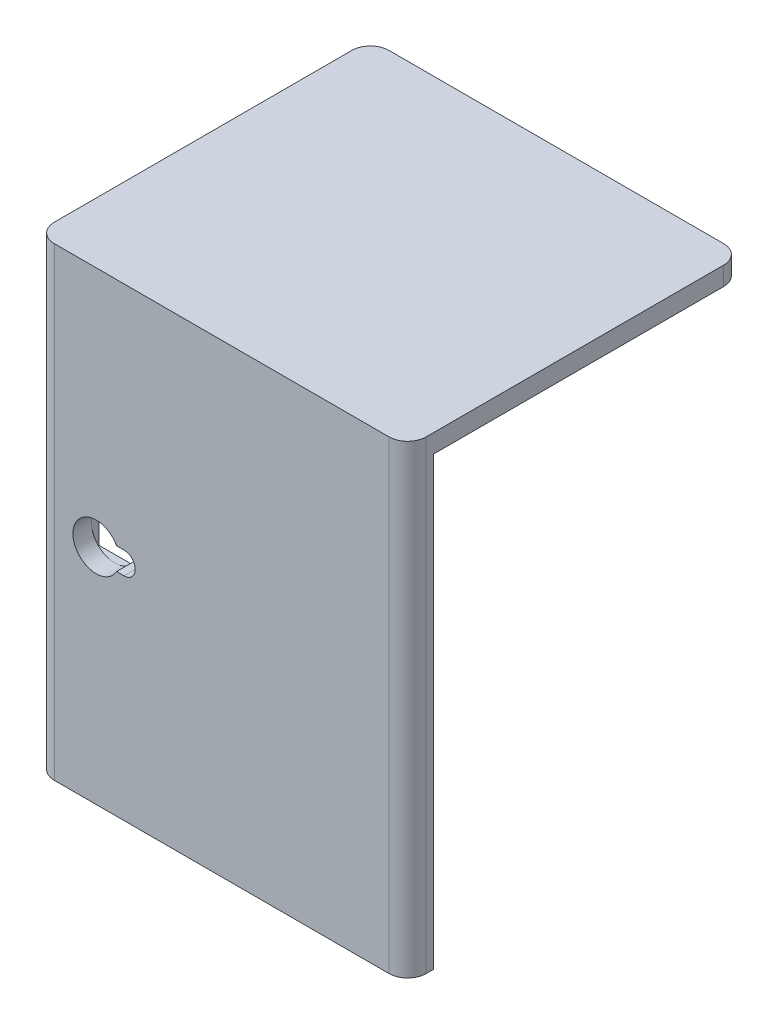
ISO-10303-21;
HEADER;
FILE_DESCRIPTION(('STEP AP214'),'2;1');
FILE_NAME('part.step','',(''),(''),'','','');
FILE_SCHEMA(('AUTOMOTIVE_DESIGN { 1 0 10303 214 1 1 1 1 }'));
ENDSEC;
DATA;
#1=APPLICATION_CONTEXT('core data for automotive mechanical design processes');
#2=APPLICATION_PROTOCOL_DEFINITION('international standard','automotive_design',2000,#1);
#3=PRODUCT_CONTEXT('',#1,'mechanical');
#4=PRODUCT('Part','Part','',(#3));
#5=PRODUCT_RELATED_PRODUCT_CATEGORY('part','',(#4));
#6=PRODUCT_DEFINITION_FORMATION('','',#4);
#7=PRODUCT_DEFINITION_CONTEXT('part definition',#1,'design');
#8=PRODUCT_DEFINITION('design','',#6,#7);
#9=PRODUCT_DEFINITION_SHAPE('','',#8);
#10=(LENGTH_UNIT() NAMED_UNIT(*) SI_UNIT(.MILLI.,.METRE.));
#11=(NAMED_UNIT(*) PLANE_ANGLE_UNIT() SI_UNIT($,.RADIAN.));
#12=(NAMED_UNIT(*) SI_UNIT($,.STERADIAN.) SOLID_ANGLE_UNIT());
#13=UNCERTAINTY_MEASURE_WITH_UNIT(LENGTH_MEASURE(1.E-05),#10,'distance_accuracy_value','');
#14=(GEOMETRIC_REPRESENTATION_CONTEXT(3) GLOBAL_UNCERTAINTY_ASSIGNED_CONTEXT((#13)) GLOBAL_UNIT_ASSIGNED_CONTEXT((#10,
#11,#12)) REPRESENTATION_CONTEXT('',''));
#15=CARTESIAN_POINT('',(0.,0.,0.));
#16=DIRECTION('',(0.,0.,1.));
#17=DIRECTION('',(1.,0.,0.));
#18=AXIS2_PLACEMENT_3D('',#15,#16,#17);
#19=CARTESIAN_POINT('',(-33.75,60.,158.));
#20=DIRECTION('',(0.,0.,-1.));
#21=DIRECTION('',(-1.,0.,0.));
#22=AXIS2_PLACEMENT_3D('',#19,#20,#21);
#23=CYLINDRICAL_SURFACE('',#22,6.25);
#24=CARTESIAN_POINT('',(-33.75,60.,40.));
#25=DIRECTION('',(0.,0.,1.));
#26=DIRECTION('',(1.,0.,0.));
#27=AXIS2_PLACEMENT_3D('',#24,#25,#26);
#28=CIRCLE('',#27,6.25);
#29=CARTESIAN_POINT('',(-33.75,53.75,40.));
#30=VERTEX_POINT('',#29);
#31=CARTESIAN_POINT('',(-40.,60.,40.));
#32=VERTEX_POINT('',#31);
#33=EDGE_CURVE('E224',#30,#32,#28,.F.);
#34=ORIENTED_EDGE('',*,*,#33,.T.);
#35=CARTESIAN_POINT('',(-33.75,66.25,40.));
#36=VERTEX_POINT('',#35);
#37=EDGE_CURVE('E183',#32,#36,#28,.F.);
#38=ORIENTED_EDGE('',*,*,#37,.T.);
#39=CARTESIAN_POINT('',(-28.2670719501347,63.,40.));
#40=VERTEX_POINT('',#39);
#41=EDGE_CURVE('E225',#36,#40,#28,.F.);
#42=ORIENTED_EDGE('',*,*,#41,.T.);
#43=DIRECTION('',(0.,0.,-1.));
#44=VECTOR('',#43,1.);
#45=CARTESIAN_POINT('',(-28.2670719501347,63.,158.));
#46=LINE('',#45,#44);
#47=CARTESIAN_POINT('',(-28.2670719501347,63.,45.));
#48=VERTEX_POINT('',#47);
#49=EDGE_CURVE('E236',#48,#40,#46,.T.);
#50=ORIENTED_EDGE('',*,*,#49,.F.);
#51=CARTESIAN_POINT('',(-33.75,60.,45.));
#52=DIRECTION('',(0.,0.,-1.));
#53=DIRECTION('',(-1.,0.,0.));
#54=AXIS2_PLACEMENT_3D('',#51,#52,#53);
#55=CIRCLE('',#54,6.25);
#56=CARTESIAN_POINT('',(-28.2670719501347,57.,45.));
#57=VERTEX_POINT('',#56);
#58=EDGE_CURVE('E247',#57,#48,#55,.T.);
#59=ORIENTED_EDGE('',*,*,#58,.F.);
#60=DIRECTION('',(0.,0.,-1.));
#61=VECTOR('',#60,1.);
#62=CARTESIAN_POINT('',(-28.2670719501347,57.,158.));
#63=LINE('',#62,#61);
#64=CARTESIAN_POINT('',(-28.2670719501347,57.,40.));
#65=VERTEX_POINT('',#64);
#66=EDGE_CURVE('E239',#57,#65,#63,.T.);
#67=ORIENTED_EDGE('',*,*,#66,.T.);
#68=EDGE_CURVE('E66',#65,#30,#28,.F.);
#69=ORIENTED_EDGE('',*,*,#68,.T.);
#70=EDGE_LOOP('',(#34,#38,#42,#50,#59,#67,#69));
#71=FACE_BOUND('',#70,.T.);
#72=ADVANCED_FACE('F43',(#71),#23,.F.);
#73=CARTESIAN_POINT('',(50.,125.,45.));
#74=DIRECTION('',(-1.,0.,0.));
#75=DIRECTION('',(0.,0.,1.));
#76=AXIS2_PLACEMENT_3D('',#73,#74,#75);
#77=PLANE('',#76);
#78=DIRECTION('',(0.,0.,-1.));
#79=VECTOR('',#78,1.);
#80=CARTESIAN_POINT('',(50.,125.,45.));
#81=LINE('',#80,#79);
#82=CARTESIAN_POINT('',(50.,125.,40.));
#83=VERTEX_POINT('',#82);
#84=CARTESIAN_POINT('',(50.,125.,-40.));
#85=VERTEX_POINT('',#84);
#86=EDGE_CURVE('E276',#83,#85,#81,.T.);
#87=ORIENTED_EDGE('',*,*,#86,.F.);
#88=DIRECTION('',(0.,-1.,0.));
#89=VECTOR('',#88,1.);
#90=CARTESIAN_POINT('',(50.,125.,40.));
#91=LINE('',#90,#89);
#92=CARTESIAN_POINT('',(50.,0.,40.));
#93=VERTEX_POINT('',#92);
#94=EDGE_CURVE('E319',#83,#93,#91,.T.);
#95=ORIENTED_EDGE('',*,*,#94,.T.);
#96=DIRECTION('',(0.,0.,-1.));
#97=VECTOR('',#96,1.);
#98=CARTESIAN_POINT('',(50.,0.,45.));
#99=LINE('',#98,#97);
#100=CARTESIAN_POINT('',(50.,0.,38.));
#101=VERTEX_POINT('',#100);
#102=EDGE_CURVE('E273',#93,#101,#99,.T.);
#103=ORIENTED_EDGE('',*,*,#102,.T.);
#104=DIRECTION('',(0.,-1.,0.));
#105=VECTOR('',#104,1.);
#106=CARTESIAN_POINT('',(50.,120.,38.));
#107=LINE('',#106,#105);
#108=CARTESIAN_POINT('',(50.,120.,38.));
#109=VERTEX_POINT('',#108);
#110=EDGE_CURVE('E268',#109,#101,#107,.T.);
#111=ORIENTED_EDGE('',*,*,#110,.F.);
#112=DIRECTION('',(0.,0.,1.));
#113=VECTOR('',#112,1.);
#114=CARTESIAN_POINT('',(50.,120.,-45.));
#115=LINE('',#114,#113);
#116=CARTESIAN_POINT('',(50.,120.,-40.));
#117=VERTEX_POINT('',#116);
#118=EDGE_CURVE('E257',#117,#109,#115,.T.);
#119=ORIENTED_EDGE('',*,*,#118,.F.);
#120=DIRECTION('',(0.,-1.,0.));
#121=VECTOR('',#120,1.);
#122=CARTESIAN_POINT('',(50.,125.,-40.));
#123=LINE('',#122,#121);
#124=EDGE_CURVE('E317',#117,#85,#123,.F.);
#125=ORIENTED_EDGE('',*,*,#124,.T.);
#126=EDGE_LOOP('',(#87,#95,#103,#111,#119,#125));
#127=FACE_BOUND('',#126,.T.);
#128=ADVANCED_FACE('F339',(#127),#77,.F.);
#129=CARTESIAN_POINT('',(-50.,125.,-45.));
#130=DIRECTION('',(0.,0.,1.));
#131=DIRECTION('',(1.,0.,0.));
#132=AXIS2_PLACEMENT_3D('',#129,#130,#131);
#133=PLANE('',#132);
#134=DIRECTION('',(-1.,0.,0.));
#135=VECTOR('',#134,1.);
#136=CARTESIAN_POINT('',(-50.,125.,-45.));
#137=LINE('',#136,#135);
#138=CARTESIAN_POINT('',(45.,125.,-45.));
#139=VERTEX_POINT('',#138);
#140=CARTESIAN_POINT('',(-45.,125.,-45.));
#141=VERTEX_POINT('',#140);
#142=EDGE_CURVE('E279',#139,#141,#137,.T.);
#143=ORIENTED_EDGE('',*,*,#142,.F.);
#144=DIRECTION('',(0.,-1.,0.));
#145=VECTOR('',#144,1.);
#146=CARTESIAN_POINT('',(45.,125.,-45.));
#147=LINE('',#146,#145);
#148=CARTESIAN_POINT('',(45.,120.,-45.));
#149=VERTEX_POINT('',#148);
#150=EDGE_CURVE('E324',#139,#149,#147,.T.);
#151=ORIENTED_EDGE('',*,*,#150,.T.);
#152=DIRECTION('',(1.,0.,0.));
#153=VECTOR('',#152,1.);
#154=CARTESIAN_POINT('',(-50.,120.,-45.));
#155=LINE('',#154,#153);
#156=CARTESIAN_POINT('',(-45.,120.,-45.));
#157=VERTEX_POINT('',#156);
#158=EDGE_CURVE('E265',#157,#149,#155,.T.);
#159=ORIENTED_EDGE('',*,*,#158,.F.);
#160=DIRECTION('',(0.,-1.,0.));
#161=VECTOR('',#160,1.);
#162=CARTESIAN_POINT('',(-45.,125.,-45.));
#163=LINE('',#162,#161);
#164=EDGE_CURVE('E322',#157,#141,#163,.F.);
#165=ORIENTED_EDGE('',*,*,#164,.T.);
#166=EDGE_LOOP('',(#143,#151,#159,#165));
#167=FACE_BOUND('',#166,.T.);
#168=ADVANCED_FACE('F347',(#167),#133,.F.);
#169=CARTESIAN_POINT('',(-50.,125.,45.));
#170=DIRECTION('',(1.,0.,0.));
#171=DIRECTION('',(0.,0.,-1.));
#172=AXIS2_PLACEMENT_3D('',#169,#170,#171);
#173=PLANE('',#172);
#174=DIRECTION('',(0.,0.,1.));
#175=VECTOR('',#174,1.);
#176=CARTESIAN_POINT('',(-50.,0.,45.));
#177=LINE('',#176,#175);
#178=CARTESIAN_POINT('',(-50.,0.,38.));
#179=VERTEX_POINT('',#178);
#180=CARTESIAN_POINT('',(-50.,0.,40.));
#181=VERTEX_POINT('',#180);
#182=EDGE_CURVE('E291',#179,#181,#177,.T.);
#183=ORIENTED_EDGE('',*,*,#182,.T.);
#184=DIRECTION('',(0.,-1.,0.));
#185=VECTOR('',#184,1.);
#186=CARTESIAN_POINT('',(-50.,125.,40.));
#187=LINE('',#186,#185);
#188=CARTESIAN_POINT('',(-50.,125.,40.));
#189=VERTEX_POINT('',#188);
#190=EDGE_CURVE('E307',#181,#189,#187,.F.);
#191=ORIENTED_EDGE('',*,*,#190,.T.);
#192=DIRECTION('',(0.,0.,1.));
#193=VECTOR('',#192,1.);
#194=CARTESIAN_POINT('',(-50.,125.,45.));
#195=LINE('',#194,#193);
#196=CARTESIAN_POINT('',(-50.,125.,-40.));
#197=VERTEX_POINT('',#196);
#198=EDGE_CURVE('E283',#197,#189,#195,.T.);
#199=ORIENTED_EDGE('',*,*,#198,.F.);
#200=DIRECTION('',(0.,-1.,0.));
#201=VECTOR('',#200,1.);
#202=CARTESIAN_POINT('',(-50.,125.,-40.));
#203=LINE('',#202,#201);
#204=CARTESIAN_POINT('',(-50.,120.,-40.));
#205=VERTEX_POINT('',#204);
#206=EDGE_CURVE('E304',#197,#205,#203,.T.);
#207=ORIENTED_EDGE('',*,*,#206,.T.);
#208=DIRECTION('',(0.,0.,-1.));
#209=VECTOR('',#208,1.);
#210=CARTESIAN_POINT('',(-50.,120.,-45.));
#211=LINE('',#210,#209);
#212=CARTESIAN_POINT('',(-50.,120.,38.));
#213=VERTEX_POINT('',#212);
#214=EDGE_CURVE('E262',#213,#205,#211,.T.);
#215=ORIENTED_EDGE('',*,*,#214,.F.);
#216=DIRECTION('',(0.,-1.,0.));
#217=VECTOR('',#216,1.);
#218=CARTESIAN_POINT('',(-50.,120.,38.));
#219=LINE('',#218,#217);
#220=EDGE_CURVE('E270',#213,#179,#219,.T.);
#221=ORIENTED_EDGE('',*,*,#220,.T.);
#222=EDGE_LOOP('',(#183,#191,#199,#207,#215,#221));
#223=FACE_BOUND('',#222,.T.);
#224=ADVANCED_FACE('F354',(#223),#173,.F.);
#225=CARTESIAN_POINT('',(-50.,125.,45.));
#226=DIRECTION('',(0.,0.,-1.));
#227=DIRECTION('',(-1.,0.,0.));
#228=AXIS2_PLACEMENT_3D('',#225,#226,#227);
#229=PLANE('',#228);
#230=DIRECTION('',(1.,0.,0.));
#231=VECTOR('',#230,1.);
#232=CARTESIAN_POINT('',(-50.,63.,45.));
#233=LINE('',#232,#231);
#234=CARTESIAN_POINT('',(-26.25,63.,45.));
#235=VERTEX_POINT('',#234);
#236=EDGE_CURVE('E250',#48,#235,#233,.T.);
#237=ORIENTED_EDGE('',*,*,#236,.T.);
#238=CARTESIAN_POINT('',(-26.25,60.,45.));
#239=DIRECTION('',(0.,0.,-1.));
#240=DIRECTION('',(-1.,0.,0.));
#241=AXIS2_PLACEMENT_3D('',#238,#239,#240);
#242=CIRCLE('',#241,3.);
#243=CARTESIAN_POINT('',(-26.25,57.,45.));
#244=VERTEX_POINT('',#243);
#245=EDGE_CURVE('E253',#235,#244,#242,.T.);
#246=ORIENTED_EDGE('',*,*,#245,.T.);
#247=DIRECTION('',(-1.,0.,0.));
#248=VECTOR('',#247,1.);
#249=CARTESIAN_POINT('',(-50.,57.,45.));
#250=LINE('',#249,#248);
#251=EDGE_CURVE('E235',#244,#57,#250,.T.);
#252=ORIENTED_EDGE('',*,*,#251,.T.);
#253=ORIENTED_EDGE('',*,*,#58,.T.);
#254=EDGE_LOOP('',(#237,#246,#252,#253));
#255=FACE_BOUND('',#254,.T.);
#256=DIRECTION('',(1.,0.,0.));
#257=VECTOR('',#256,1.);
#258=CARTESIAN_POINT('',(-50.,125.,45.));
#259=LINE('',#258,#257);
#260=CARTESIAN_POINT('',(-45.,125.,45.));
#261=VERTEX_POINT('',#260);
#262=CARTESIAN_POINT('',(45.,125.,45.));
#263=VERTEX_POINT('',#262);
#264=EDGE_CURVE('E286',#261,#263,#259,.T.);
#265=ORIENTED_EDGE('',*,*,#264,.F.);
#266=DIRECTION('',(0.,-1.,0.));
#267=VECTOR('',#266,1.);
#268=CARTESIAN_POINT('',(-45.,125.,45.));
#269=LINE('',#268,#267);
#270=CARTESIAN_POINT('',(-45.,0.,45.));
#271=VERTEX_POINT('',#270);
#272=EDGE_CURVE('E297',#261,#271,#269,.T.);
#273=ORIENTED_EDGE('',*,*,#272,.T.);
#274=DIRECTION('',(1.,0.,0.));
#275=VECTOR('',#274,1.);
#276=CARTESIAN_POINT('',(-50.,0.,45.));
#277=LINE('',#276,#275);
#278=CARTESIAN_POINT('',(45.,0.,45.));
#279=VERTEX_POINT('',#278);
#280=EDGE_CURVE('E280',#271,#279,#277,.T.);
#281=ORIENTED_EDGE('',*,*,#280,.T.);
#282=DIRECTION('',(0.,-1.,0.));
#283=VECTOR('',#282,1.);
#284=CARTESIAN_POINT('',(45.,125.,45.));
#285=LINE('',#284,#283);
#286=EDGE_CURVE('E289',#279,#263,#285,.F.);
#287=ORIENTED_EDGE('',*,*,#286,.T.);
#288=EDGE_LOOP('',(#265,#273,#281,#287));
#289=FACE_BOUND('',#288,.T.);
#290=ADVANCED_FACE('F364',(#255,#289),#229,.F.);
#291=CARTESIAN_POINT('',(0.,125.,0.));
#292=DIRECTION('',(0.,-1.,0.));
#293=DIRECTION('',(0.,0.,-1.));
#294=AXIS2_PLACEMENT_3D('',#291,#292,#293);
#295=PLANE('',#294);
#296=ORIENTED_EDGE('',*,*,#198,.T.);
#297=CARTESIAN_POINT('',(-45.,125.,40.));
#298=DIRECTION('',(0.,-1.,0.));
#299=DIRECTION('',(0.,0.,-1.));
#300=AXIS2_PLACEMENT_3D('',#297,#298,#299);
#301=CIRCLE('',#300,5.);
#302=EDGE_CURVE('E315',#189,#261,#301,.F.);
#303=ORIENTED_EDGE('',*,*,#302,.T.);
#304=ORIENTED_EDGE('',*,*,#264,.T.);
#305=CARTESIAN_POINT('',(45.,125.,40.));
#306=DIRECTION('',(0.,-1.,0.));
#307=DIRECTION('',(0.,0.,-1.));
#308=AXIS2_PLACEMENT_3D('',#305,#306,#307);
#309=CIRCLE('',#308,5.);
#310=EDGE_CURVE('E313',#263,#83,#309,.F.);
#311=ORIENTED_EDGE('',*,*,#310,.T.);
#312=ORIENTED_EDGE('',*,*,#86,.T.);
#313=CARTESIAN_POINT('',(45.,125.,-40.));
#314=DIRECTION('',(0.,-1.,0.));
#315=DIRECTION('',(0.,0.,-1.));
#316=AXIS2_PLACEMENT_3D('',#313,#314,#315);
#317=CIRCLE('',#316,5.);
#318=EDGE_CURVE('E311',#85,#139,#317,.F.);
#319=ORIENTED_EDGE('',*,*,#318,.T.);
#320=ORIENTED_EDGE('',*,*,#142,.T.);
#321=CARTESIAN_POINT('',(-45.,125.,-40.));
#322=DIRECTION('',(0.,-1.,0.));
#323=DIRECTION('',(0.,0.,-1.));
#324=AXIS2_PLACEMENT_3D('',#321,#322,#323);
#325=CIRCLE('',#324,5.);
#326=EDGE_CURVE('E309',#141,#197,#325,.F.);
#327=ORIENTED_EDGE('',*,*,#326,.T.);
#328=EDGE_LOOP('',(#296,#303,#304,#311,#312,#319,#320,#327));
#329=FACE_BOUND('',#328,.T.);
#330=ADVANCED_FACE('F344',(#329),#295,.F.);
#331=CARTESIAN_POINT('',(0.,0.,0.));
#332=DIRECTION('',(0.,-1.,0.));
#333=DIRECTION('',(0.,0.,-1.));
#334=AXIS2_PLACEMENT_3D('',#331,#332,#333);
#335=PLANE('',#334);
#336=ORIENTED_EDGE('',*,*,#280,.F.);
#337=CARTESIAN_POINT('',(-45.,0.,40.));
#338=DIRECTION('',(0.,-1.,0.));
#339=DIRECTION('',(0.,0.,-1.));
#340=AXIS2_PLACEMENT_3D('',#337,#338,#339);
#341=CIRCLE('',#340,5.);
#342=EDGE_CURVE('E302',#271,#181,#341,.T.);
#343=ORIENTED_EDGE('',*,*,#342,.T.);
#344=ORIENTED_EDGE('',*,*,#182,.F.);
#345=DIRECTION('',(-1.,0.,0.));
#346=VECTOR('',#345,1.);
#347=CARTESIAN_POINT('',(-50.,0.,38.));
#348=LINE('',#347,#346);
#349=EDGE_CURVE('E256',#101,#179,#348,.T.);
#350=ORIENTED_EDGE('',*,*,#349,.F.);
#351=ORIENTED_EDGE('',*,*,#102,.F.);
#352=CARTESIAN_POINT('',(45.,0.,40.));
#353=DIRECTION('',(0.,-1.,0.));
#354=DIRECTION('',(0.,0.,-1.));
#355=AXIS2_PLACEMENT_3D('',#352,#353,#354);
#356=CIRCLE('',#355,5.);
#357=EDGE_CURVE('E300',#93,#279,#356,.T.);
#358=ORIENTED_EDGE('',*,*,#357,.T.);
#359=EDGE_LOOP('',(#336,#343,#344,#350,#351,#358));
#360=FACE_BOUND('',#359,.T.);
#361=ADVANCED_FACE('F373',(#360),#335,.T.);
#362=CARTESIAN_POINT('',(-50.,120.,38.));
#363=DIRECTION('',(0.,0.,1.));
#364=DIRECTION('',(1.,0.,0.));
#365=AXIS2_PLACEMENT_3D('',#362,#363,#364);
#366=PLANE('',#365);
#367=DIRECTION('',(1.,0.,0.));
#368=VECTOR('',#367,1.);
#369=CARTESIAN_POINT('',(-40.,66.25,38.));
#370=LINE('',#369,#368);
#371=CARTESIAN_POINT('',(-40.,66.25,38.));
#372=VERTEX_POINT('',#371);
#373=CARTESIAN_POINT('',(-17.,66.25,38.));
#374=VERTEX_POINT('',#373);
#375=EDGE_CURVE('E58',#372,#374,#370,.T.);
#376=ORIENTED_EDGE('',*,*,#375,.F.);
#377=DIRECTION('',(0.,1.,0.));
#378=VECTOR('',#377,1.);
#379=CARTESIAN_POINT('',(-40.,66.25,38.));
#380=LINE('',#379,#378);
#381=CARTESIAN_POINT('',(-40.,53.75,38.));
#382=VERTEX_POINT('',#381);
#383=EDGE_CURVE('E194',#382,#372,#380,.T.);
#384=ORIENTED_EDGE('',*,*,#383,.F.);
#385=DIRECTION('',(-1.,0.,0.));
#386=VECTOR('',#385,1.);
#387=CARTESIAN_POINT('',(-40.,53.75,38.));
#388=LINE('',#387,#386);
#389=CARTESIAN_POINT('',(-17.,53.75,38.));
#390=VERTEX_POINT('',#389);
#391=EDGE_CURVE('E188',#390,#382,#388,.T.);
#392=ORIENTED_EDGE('',*,*,#391,.F.);
#393=DIRECTION('',(0.,-1.,0.));
#394=VECTOR('',#393,1.);
#395=CARTESIAN_POINT('',(-17.,66.25,38.));
#396=LINE('',#395,#394);
#397=EDGE_CURVE('E212',#374,#390,#396,.T.);
#398=ORIENTED_EDGE('',*,*,#397,.F.);
#399=EDGE_LOOP('',(#376,#384,#392,#398));
#400=FACE_BOUND('',#399,.T.);
#401=ORIENTED_EDGE('',*,*,#349,.T.);
#402=ORIENTED_EDGE('',*,*,#220,.F.);
#403=DIRECTION('',(-1.,0.,0.));
#404=VECTOR('',#403,1.);
#405=CARTESIAN_POINT('',(-50.,120.,38.));
#406=LINE('',#405,#404);
#407=EDGE_CURVE('E259',#109,#213,#406,.T.);
#408=ORIENTED_EDGE('',*,*,#407,.F.);
#409=ORIENTED_EDGE('',*,*,#110,.T.);
#410=EDGE_LOOP('',(#401,#402,#408,#409));
#411=FACE_BOUND('',#410,.T.);
#412=ADVANCED_FACE('F375',(#400,#411),#366,.F.);
#413=CARTESIAN_POINT('',(0.,120.,0.));
#414=DIRECTION('',(0.,1.,0.));
#415=DIRECTION('',(0.,0.,1.));
#416=AXIS2_PLACEMENT_3D('',#413,#414,#415);
#417=PLANE('',#416);
#418=ORIENTED_EDGE('',*,*,#158,.T.);
#419=CARTESIAN_POINT('',(45.,120.,-40.));
#420=DIRECTION('',(0.,1.,0.));
#421=DIRECTION('',(0.,0.,1.));
#422=AXIS2_PLACEMENT_3D('',#419,#420,#421);
#423=CIRCLE('',#422,5.);
#424=EDGE_CURVE('E51',#149,#117,#423,.F.);
#425=ORIENTED_EDGE('',*,*,#424,.T.);
#426=ORIENTED_EDGE('',*,*,#118,.T.);
#427=ORIENTED_EDGE('',*,*,#407,.T.);
#428=ORIENTED_EDGE('',*,*,#214,.T.);
#429=CARTESIAN_POINT('',(-45.,120.,-40.));
#430=DIRECTION('',(0.,1.,0.));
#431=DIRECTION('',(0.,0.,1.));
#432=AXIS2_PLACEMENT_3D('',#429,#430,#431);
#433=CIRCLE('',#432,5.);
#434=EDGE_CURVE('E327',#205,#157,#433,.F.);
#435=ORIENTED_EDGE('',*,*,#434,.T.);
#436=EDGE_LOOP('',(#418,#425,#426,#427,#428,#435));
#437=FACE_BOUND('',#436,.T.);
#438=ADVANCED_FACE('F330',(#437),#417,.F.);
#439=CARTESIAN_POINT('',(-45.,125.,40.));
#440=DIRECTION('',(0.,-1.,0.));
#441=DIRECTION('',(0.,0.,-1.));
#442=AXIS2_PLACEMENT_3D('',#439,#440,#441);
#443=CYLINDRICAL_SURFACE('',#442,5.);
#444=ORIENTED_EDGE('',*,*,#302,.F.);
#445=ORIENTED_EDGE('',*,*,#190,.F.);
#446=ORIENTED_EDGE('',*,*,#342,.F.);
#447=ORIENTED_EDGE('',*,*,#272,.F.);
#448=EDGE_LOOP('',(#444,#445,#446,#447));
#449=FACE_BOUND('',#448,.T.);
#450=ADVANCED_FACE('F359',(#449),#443,.T.);
#451=CARTESIAN_POINT('',(45.,125.,40.));
#452=DIRECTION('',(0.,-1.,0.));
#453=DIRECTION('',(0.,0.,-1.));
#454=AXIS2_PLACEMENT_3D('',#451,#452,#453);
#455=CYLINDRICAL_SURFACE('',#454,5.);
#456=ORIENTED_EDGE('',*,*,#310,.F.);
#457=ORIENTED_EDGE('',*,*,#286,.F.);
#458=ORIENTED_EDGE('',*,*,#357,.F.);
#459=ORIENTED_EDGE('',*,*,#94,.F.);
#460=EDGE_LOOP('',(#456,#457,#458,#459));
#461=FACE_BOUND('',#460,.T.);
#462=ADVANCED_FACE('F368',(#461),#455,.T.);
#463=CARTESIAN_POINT('',(45.,125.,-40.));
#464=DIRECTION('',(0.,-1.,0.));
#465=DIRECTION('',(0.,0.,-1.));
#466=AXIS2_PLACEMENT_3D('',#463,#464,#465);
#467=CYLINDRICAL_SURFACE('',#466,5.);
#468=ORIENTED_EDGE('',*,*,#318,.F.);
#469=ORIENTED_EDGE('',*,*,#124,.F.);
#470=ORIENTED_EDGE('',*,*,#424,.F.);
#471=ORIENTED_EDGE('',*,*,#150,.F.);
#472=EDGE_LOOP('',(#468,#469,#470,#471));
#473=FACE_BOUND('',#472,.T.);
#474=ADVANCED_FACE('F341',(#473),#467,.T.);
#475=CARTESIAN_POINT('',(-45.,125.,-40.));
#476=DIRECTION('',(0.,-1.,0.));
#477=DIRECTION('',(0.,0.,-1.));
#478=AXIS2_PLACEMENT_3D('',#475,#476,#477);
#479=CYLINDRICAL_SURFACE('',#478,5.);
#480=ORIENTED_EDGE('',*,*,#326,.F.);
#481=ORIENTED_EDGE('',*,*,#164,.F.);
#482=ORIENTED_EDGE('',*,*,#434,.F.);
#483=ORIENTED_EDGE('',*,*,#206,.F.);
#484=EDGE_LOOP('',(#480,#481,#482,#483));
#485=FACE_BOUND('',#484,.T.);
#486=ADVANCED_FACE('F45',(#485),#479,.T.);
#487=CARTESIAN_POINT('',(-26.25,60.,158.));
#488=DIRECTION('',(0.,0.,-1.));
#489=DIRECTION('',(-1.,0.,0.));
#490=AXIS2_PLACEMENT_3D('',#487,#488,#489);
#491=CYLINDRICAL_SURFACE('',#490,3.);
#492=DIRECTION('',(0.,0.,-1.));
#493=VECTOR('',#492,1.);
#494=CARTESIAN_POINT('',(-26.25,63.,158.));
#495=LINE('',#494,#493);
#496=CARTESIAN_POINT('',(-26.25,63.,40.));
#497=VERTEX_POINT('',#496);
#498=EDGE_CURVE('E232',#235,#497,#495,.T.);
#499=ORIENTED_EDGE('',*,*,#498,.T.);
#500=CARTESIAN_POINT('',(-26.25,60.,40.));
#501=DIRECTION('',(0.,0.,1.));
#502=DIRECTION('',(1.,0.,0.));
#503=AXIS2_PLACEMENT_3D('',#500,#501,#502);
#504=CIRCLE('',#503,3.);
#505=CARTESIAN_POINT('',(-26.25,57.,40.));
#506=VERTEX_POINT('',#505);
#507=EDGE_CURVE('E226',#497,#506,#504,.F.);
#508=ORIENTED_EDGE('',*,*,#507,.T.);
#509=DIRECTION('',(0.,0.,-1.));
#510=VECTOR('',#509,1.);
#511=CARTESIAN_POINT('',(-26.25,57.,158.));
#512=LINE('',#511,#510);
#513=EDGE_CURVE('E242',#244,#506,#512,.T.);
#514=ORIENTED_EDGE('',*,*,#513,.F.);
#515=ORIENTED_EDGE('',*,*,#245,.F.);
#516=EDGE_LOOP('',(#499,#508,#514,#515));
#517=FACE_BOUND('',#516,.T.);
#518=ADVANCED_FACE('F403',(#517),#491,.F.);
#519=CARTESIAN_POINT('',(-26.25,63.,158.));
#520=DIRECTION('',(0.,1.,0.));
#521=DIRECTION('',(0.,0.,1.));
#522=AXIS2_PLACEMENT_3D('',#519,#520,#521);
#523=PLANE('',#522);
#524=ORIENTED_EDGE('',*,*,#49,.T.);
#525=DIRECTION('',(1.,0.,0.));
#526=VECTOR('',#525,1.);
#527=CARTESIAN_POINT('',(-26.25,63.,40.));
#528=LINE('',#527,#526);
#529=EDGE_CURVE('E229',#40,#497,#528,.T.);
#530=ORIENTED_EDGE('',*,*,#529,.T.);
#531=ORIENTED_EDGE('',*,*,#498,.F.);
#532=ORIENTED_EDGE('',*,*,#236,.F.);
#533=EDGE_LOOP('',(#524,#530,#531,#532));
#534=FACE_BOUND('',#533,.T.);
#535=ADVANCED_FACE('F397',(#534),#523,.F.);
#536=CARTESIAN_POINT('',(-26.25,57.,158.));
#537=DIRECTION('',(0.,-1.,0.));
#538=DIRECTION('',(0.,0.,-1.));
#539=AXIS2_PLACEMENT_3D('',#536,#537,#538);
#540=PLANE('',#539);
#541=ORIENTED_EDGE('',*,*,#513,.T.);
#542=DIRECTION('',(-1.,0.,0.));
#543=VECTOR('',#542,1.);
#544=CARTESIAN_POINT('',(-26.25,57.,40.));
#545=LINE('',#544,#543);
#546=EDGE_CURVE('E11',#506,#65,#545,.T.);
#547=ORIENTED_EDGE('',*,*,#546,.T.);
#548=ORIENTED_EDGE('',*,*,#66,.F.);
#549=ORIENTED_EDGE('',*,*,#251,.F.);
#550=EDGE_LOOP('',(#541,#547,#548,#549));
#551=FACE_BOUND('',#550,.T.);
#552=ADVANCED_FACE('F399',(#551),#540,.F.);
#553=CARTESIAN_POINT('',(-40.,66.25,40.));
#554=DIRECTION('',(-1.,0.,0.));
#555=DIRECTION('',(0.,0.,1.));
#556=AXIS2_PLACEMENT_3D('',#553,#554,#555);
#557=PLANE('',#556);
#558=ORIENTED_EDGE('',*,*,#383,.T.);
#559=DIRECTION('',(0.,0.,-1.));
#560=VECTOR('',#559,1.);
#561=CARTESIAN_POINT('',(-40.,66.25,40.));
#562=LINE('',#561,#560);
#563=CARTESIAN_POINT('',(-40.,66.25,40.));
#564=VERTEX_POINT('',#563);
#565=EDGE_CURVE('E191',#564,#372,#562,.T.);
#566=ORIENTED_EDGE('',*,*,#565,.F.);
#567=DIRECTION('',(0.,1.,0.));
#568=VECTOR('',#567,1.);
#569=CARTESIAN_POINT('',(-40.,66.25,40.));
#570=LINE('',#569,#568);
#571=EDGE_CURVE('E177',#32,#564,#570,.T.);
#572=ORIENTED_EDGE('',*,*,#571,.F.);
#573=CARTESIAN_POINT('',(-40.,53.75,40.));
#574=VERTEX_POINT('',#573);
#575=EDGE_CURVE('E187',#574,#32,#570,.T.);
#576=ORIENTED_EDGE('',*,*,#575,.F.);
#577=DIRECTION('',(0.,0.,-1.));
#578=VECTOR('',#577,1.);
#579=CARTESIAN_POINT('',(-40.,53.75,40.));
#580=LINE('',#579,#578);
#581=EDGE_CURVE('E217',#574,#382,#580,.T.);
#582=ORIENTED_EDGE('',*,*,#581,.T.);
#583=EDGE_LOOP('',(#558,#566,#572,#576,#582));
#584=FACE_BOUND('',#583,.T.);
#585=ADVANCED_FACE('F192',(#584),#557,.F.);
#586=CARTESIAN_POINT('',(-40.,53.75,40.));
#587=DIRECTION('',(0.,-1.,0.));
#588=DIRECTION('',(0.,0.,-1.));
#589=AXIS2_PLACEMENT_3D('',#586,#587,#588);
#590=PLANE('',#589);
#591=ORIENTED_EDGE('',*,*,#391,.T.);
#592=ORIENTED_EDGE('',*,*,#581,.F.);
#593=DIRECTION('',(-1.,0.,0.));
#594=VECTOR('',#593,1.);
#595=CARTESIAN_POINT('',(-40.,53.75,40.));
#596=LINE('',#595,#594);
#597=EDGE_CURVE('E206',#30,#574,#596,.T.);
#598=ORIENTED_EDGE('',*,*,#597,.F.);
#599=CARTESIAN_POINT('',(-17.,53.75,40.));
#600=VERTEX_POINT('',#599);
#601=EDGE_CURVE('E197',#600,#30,#596,.T.);
#602=ORIENTED_EDGE('',*,*,#601,.F.);
#603=DIRECTION('',(0.,0.,-1.));
#604=VECTOR('',#603,1.);
#605=CARTESIAN_POINT('',(-17.,53.75,40.));
#606=LINE('',#605,#604);
#607=EDGE_CURVE('E219',#600,#390,#606,.T.);
#608=ORIENTED_EDGE('',*,*,#607,.T.);
#609=EDGE_LOOP('',(#591,#592,#598,#602,#608));
#610=FACE_BOUND('',#609,.T.);
#611=ADVANCED_FACE('F422',(#610),#590,.F.);
#612=CARTESIAN_POINT('',(-40.,66.25,40.));
#613=DIRECTION('',(0.,1.,0.));
#614=DIRECTION('',(0.,0.,1.));
#615=AXIS2_PLACEMENT_3D('',#612,#613,#614);
#616=PLANE('',#615);
#617=ORIENTED_EDGE('',*,*,#375,.T.);
#618=DIRECTION('',(0.,0.,-1.));
#619=VECTOR('',#618,1.);
#620=CARTESIAN_POINT('',(-17.,66.25,40.));
#621=LINE('',#620,#619);
#622=CARTESIAN_POINT('',(-17.,66.25,40.));
#623=VERTEX_POINT('',#622);
#624=EDGE_CURVE('E196',#623,#374,#621,.T.);
#625=ORIENTED_EDGE('',*,*,#624,.F.);
#626=DIRECTION('',(1.,0.,0.));
#627=VECTOR('',#626,1.);
#628=CARTESIAN_POINT('',(-40.,66.25,40.));
#629=LINE('',#628,#627);
#630=EDGE_CURVE('E202',#36,#623,#629,.T.);
#631=ORIENTED_EDGE('',*,*,#630,.F.);
#632=EDGE_CURVE('E181',#564,#36,#629,.T.);
#633=ORIENTED_EDGE('',*,*,#632,.F.);
#634=ORIENTED_EDGE('',*,*,#565,.T.);
#635=EDGE_LOOP('',(#617,#625,#631,#633,#634));
#636=FACE_BOUND('',#635,.T.);
#637=ADVANCED_FACE('F200',(#636),#616,.F.);
#638=CARTESIAN_POINT('',(0.,0.,40.));
#639=DIRECTION('',(0.,0.,1.));
#640=DIRECTION('',(1.,0.,0.));
#641=AXIS2_PLACEMENT_3D('',#638,#639,#640);
#642=PLANE('',#641);
#643=ORIENTED_EDGE('',*,*,#630,.T.);
#644=DIRECTION('',(0.,-1.,0.));
#645=VECTOR('',#644,1.);
#646=CARTESIAN_POINT('',(-17.,66.25,40.));
#647=LINE('',#646,#645);
#648=EDGE_CURVE('E203',#623,#600,#647,.T.);
#649=ORIENTED_EDGE('',*,*,#648,.T.);
#650=ORIENTED_EDGE('',*,*,#601,.T.);
#651=ORIENTED_EDGE('',*,*,#68,.F.);
#652=ORIENTED_EDGE('',*,*,#546,.F.);
#653=ORIENTED_EDGE('',*,*,#507,.F.);
#654=ORIENTED_EDGE('',*,*,#529,.F.);
#655=ORIENTED_EDGE('',*,*,#41,.F.);
#656=EDGE_LOOP('',(#643,#649,#650,#651,#652,#653,#654,#655));
#657=FACE_BOUND('',#656,.T.);
#658=ADVANCED_FACE('F423',(#657),#642,.F.);
#659=ORIENTED_EDGE('',*,*,#571,.T.);
#660=ORIENTED_EDGE('',*,*,#632,.T.);
#661=ORIENTED_EDGE('',*,*,#37,.F.);
#662=EDGE_LOOP('',(#659,#660,#661));
#663=FACE_BOUND('',#662,.T.);
#664=ADVANCED_FACE('F179',(#663),#642,.F.);
#665=ORIENTED_EDGE('',*,*,#597,.T.);
#666=ORIENTED_EDGE('',*,*,#575,.T.);
#667=ORIENTED_EDGE('',*,*,#33,.F.);
#668=EDGE_LOOP('',(#665,#666,#667));
#669=FACE_BOUND('',#668,.T.);
#670=ADVANCED_FACE('F418',(#669),#642,.F.);
#671=CARTESIAN_POINT('',(-17.,66.25,40.));
#672=DIRECTION('',(1.,0.,0.));
#673=DIRECTION('',(0.,1.,0.));
#674=AXIS2_PLACEMENT_3D('',#671,#672,#673);
#675=PLANE('',#674);
#676=ORIENTED_EDGE('',*,*,#397,.T.);
#677=ORIENTED_EDGE('',*,*,#607,.F.);
#678=ORIENTED_EDGE('',*,*,#648,.F.);
#679=ORIENTED_EDGE('',*,*,#624,.T.);
#680=EDGE_LOOP('',(#676,#677,#678,#679));
#681=FACE_BOUND('',#680,.T.);
#682=ADVANCED_FACE('F426',(#681),#675,.F.);
#683=CLOSED_SHELL('',(#72,#128,#168,#224,#290,#330,#361,#412,#438,#450,#462,#474,#486,#518,#535,
#552,#585,#611,#637,#658,#664,#670,#682));
#684=MANIFOLD_SOLID_BREP('B2',#683);
#685=ADVANCED_BREP_SHAPE_REPRESENTATION('',(#18,#684),#14);
#686=SHAPE_DEFINITION_REPRESENTATION(#9,#685);
ENDSEC;
END-ISO-10303-21;
